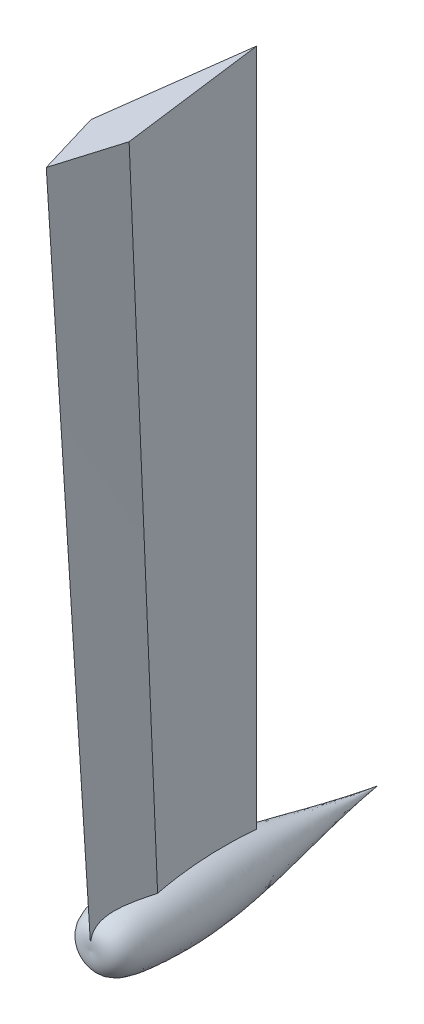
ISO-10303-21;
HEADER;
FILE_DESCRIPTION(('STEP AP214'),'2;1');
FILE_NAME('part.step','',(''),(''),'','','');
FILE_SCHEMA(('AUTOMOTIVE_DESIGN { 1 0 10303 214 1 1 1 1 }'));
ENDSEC;
DATA;
#1=APPLICATION_CONTEXT('core data for automotive mechanical design processes');
#2=APPLICATION_PROTOCOL_DEFINITION('international standard','automotive_design',2000,#1);
#3=PRODUCT_CONTEXT('',#1,'mechanical');
#4=PRODUCT('Part','Part','',(#3));
#5=PRODUCT_RELATED_PRODUCT_CATEGORY('part','',(#4));
#6=PRODUCT_DEFINITION_FORMATION('','',#4);
#7=PRODUCT_DEFINITION_CONTEXT('part definition',#1,'design');
#8=PRODUCT_DEFINITION('design','',#6,#7);
#9=PRODUCT_DEFINITION_SHAPE('','',#8);
#10=(LENGTH_UNIT() NAMED_UNIT(*) SI_UNIT(.MILLI.,.METRE.));
#11=(NAMED_UNIT(*) PLANE_ANGLE_UNIT() SI_UNIT($,.RADIAN.));
#12=(NAMED_UNIT(*) SI_UNIT($,.STERADIAN.) SOLID_ANGLE_UNIT());
#13=UNCERTAINTY_MEASURE_WITH_UNIT(LENGTH_MEASURE(1.E-05),#10,'distance_accuracy_value','');
#14=(GEOMETRIC_REPRESENTATION_CONTEXT(3) GLOBAL_UNCERTAINTY_ASSIGNED_CONTEXT((#13)) GLOBAL_UNIT_ASSIGNED_CONTEXT((#10,
#11,#12)) REPRESENTATION_CONTEXT('',''));
#15=CARTESIAN_POINT('',(0.,0.,0.));
#16=DIRECTION('',(0.,0.,1.));
#17=DIRECTION('',(1.,0.,0.));
#18=AXIS2_PLACEMENT_3D('',#15,#16,#17);
#19=CARTESIAN_POINT('',(0.,0.,0.));
#20=DIRECTION('',(0.,1.,0.));
#21=DIRECTION('',(0.,0.,1.));
#22=AXIS2_PLACEMENT_3D('',#19,#20,#21);
#23=PLANE('',#22);
#24=DIRECTION('',(0.287347885566346,0.,0.957826285221151));
#25=VECTOR('',#24,1.);
#26=CARTESIAN_POINT('',(-30.,0.,230.));
#27=LINE('',#26,#25);
#28=CARTESIAN_POINT('',(-30.,0.,230.));
#29=VERTEX_POINT('',#28);
#30=CARTESIAN_POINT('',(0.,0.,330.));
#31=VERTEX_POINT('',#30);
#32=EDGE_CURVE('E154',#29,#31,#27,.T.);
#33=ORIENTED_EDGE('',*,*,#32,.T.);
#34=DIRECTION('',(0.287347885566345,0.,-0.957826285221151));
#35=VECTOR('',#34,1.);
#36=CARTESIAN_POINT('',(0.,0.,330.));
#37=LINE('',#36,#35);
#38=CARTESIAN_POINT('',(30.,0.,230.));
#39=VERTEX_POINT('',#38);
#40=EDGE_CURVE('E146',#31,#39,#37,.T.);
#41=ORIENTED_EDGE('',*,*,#40,.T.);
#42=DIRECTION('',(-0.129339184067768,0.,-0.991600411186222));
#43=VECTOR('',#42,1.);
#44=CARTESIAN_POINT('',(30.,0.,230.));
#45=LINE('',#44,#43);
#46=CARTESIAN_POINT('',(0.,0.,0.));
#47=VERTEX_POINT('',#46);
#48=EDGE_CURVE('E153',#39,#47,#45,.T.);
#49=ORIENTED_EDGE('',*,*,#48,.T.);
#50=DIRECTION('',(-0.129339184067768,0.,0.991600411186222));
#51=VECTOR('',#50,1.);
#52=CARTESIAN_POINT('',(0.,0.,0.));
#53=LINE('',#52,#51);
#54=EDGE_CURVE('E158',#47,#29,#53,.T.);
#55=ORIENTED_EDGE('',*,*,#54,.T.);
#56=EDGE_LOOP('',(#33,#41,#49,#55));
#57=FACE_BOUND('',#56,.T.);
#58=ADVANCED_FACE('F45',(#57),#23,.T.);
#59=CARTESIAN_POINT('',(0.,0.,0.));
#60=CARTESIAN_POINT('',(0.,-1100.,0.));
#61=CARTESIAN_POINT('',(5.00000000000003,0.,38.3333333333336));
#62=CARTESIAN_POINT('',(3.33333333333331,-1100.,28.8888833333331));
#63=CARTESIAN_POINT('',(10.,0.,76.666666666667));
#64=CARTESIAN_POINT('',(6.66666666666664,-1100.,57.7777666666664));
#65=CARTESIAN_POINT('',(20.0000000000001,0.,153.333333333334));
#66=CARTESIAN_POINT('',(13.3333333333333,-1100.,115.555533333333));
#67=CARTESIAN_POINT('',(25.,0.,191.666666666667));
#68=CARTESIAN_POINT('',(16.6666666666667,-1100.,144.444416666666));
#69=CARTESIAN_POINT('',(30.,0.,230.));
#70=CARTESIAN_POINT('',(20.,-1100.,173.3333));
#71=B_SPLINE_SURFACE_WITH_KNOTS('',3,1,((#59,#60),(#61,#62),(#63,#64),(#65,#66),(#67,#68),(#69,
#70)),.UNSPECIFIED.,.F.,.F.,.F.,(4,2,4),(2,2),(0.,0.5,1.),(0.,1.),.UNSPECIFIED.);
#72=CARTESIAN_POINT('',(0.,-1063.89118838814,0.));
#73=CARTESIAN_POINT('',(0.289059954199147,-1063.42768991305,2.49118317791852));
#74=CARTESIAN_POINT('',(0.578379883597746,-1062.97350731995,4.98407508232796));
#75=CARTESIAN_POINT('',(1.15753243699709,-1062.08457834276,9.97328157182918));
#76=CARTESIAN_POINT('',(1.44736506496862,-1061.64983210989,12.4695961833954));
#77=CARTESIAN_POINT('',(2.02755449899743,-1060.80055352054,17.465814656777));
#78=CARTESIAN_POINT('',(2.3179113451837,-1060.38602278607,19.9657187900877));
#79=CARTESIAN_POINT('',(2.89911326916755,-1059.57815143796,24.9688799208408));
#80=CARTESIAN_POINT('',(3.18995834598358,-1059.18481078178,27.4721369115405));
#81=CARTESIAN_POINT('',(4.06386376526304,-1058.03719515148,34.9925405405973));
#82=CARTESIAN_POINT('',(4.6476475229354,-1057.31627759088,40.0147505721887));
#83=CARTESIAN_POINT('',(5.81697718950069,-1055.97199462778,50.0719184068257));
#84=CARTESIAN_POINT('',(6.40252305689314,-1055.34862694587,55.1068759092119));
#85=CARTESIAN_POINT('',(7.54395854740652,-1054.23891668037,64.9201915027357));
#86=CARTESIAN_POINT('',(8.09976637074969,-1053.74704372051,69.6979310791707));
#87=CARTESIAN_POINT('',(9.21256681440623,-1052.86677909706,79.262854613454));
#88=CARTESIAN_POINT('',(9.76955943493441,-1052.47838745223,84.0500385730148));
#89=CARTESIAN_POINT('',(10.8841021541112,-1051.81314861141,93.6292515194706));
#90=CARTESIAN_POINT('',(11.4416517261332,-1051.53623539006,98.4212759483333));
#91=CARTESIAN_POINT('',(12.5572785592494,-1051.10135731678,108.010773137918));
#92=CARTESIAN_POINT('',(13.1153558255082,-1050.94339364131,112.808245952058));
#93=CARTESIAN_POINT('',(14.2372626412831,-1050.75304292846,122.45448889231));
#94=CARTESIAN_POINT('',(14.8010930180898,-1050.72194824105,127.303284910592));
#95=CARTESIAN_POINT('',(15.9282990657339,-1050.7965917175,136.999867317209));
#96=CARTESIAN_POINT('',(16.4916747515828,-1050.90232516227,141.847653734598));
#97=CARTESIAN_POINT('',(17.3362830923807,-1051.16946830522,149.11842026887));
#98=CARTESIAN_POINT('',(17.6179267447935,-1051.27671187025,151.543437060032));
#99=CARTESIAN_POINT('',(18.1808616562841,-1051.52844213556,156.391587913536));
#100=CARTESIAN_POINT('',(18.4621529171767,-1051.67292864324,158.814721985549));
#101=CARTESIAN_POINT('',(19.0243265948791,-1052.00019766365,163.658771838013));
#102=CARTESIAN_POINT('',(19.3052089543436,-1052.18298510807,166.079687292431));
#103=CARTESIAN_POINT('',(19.8664334481959,-1052.58795821046,170.918327306438));
#104=CARTESIAN_POINT('',(20.1467755721804,-1052.81014461963,173.3360518043));
#105=CARTESIAN_POINT('',(20.4267946929935,-1053.05258377072,175.751804682945));
#106=B_SPLINE_CURVE_WITH_KNOTS('',3,(#72,#73,#74,#75,#76,#77,#78,#79,#80,#81,#82,#83,#84,#85,
#86,#87,#88,#89,#90,#91,#92,#93,#94,#95,#96,#97,#98,#99,#100,#101,#102,#103,#104,#105),
.UNSPECIFIED.,.F.,.F.,(4,2,2,2,2,2,2,2,2,2,2,2,2,2,2,2,4),(0.,7.65109574774084,15.302251013818,
22.9540191677567,30.6057719568119,45.9263356352838,61.246541270747,75.7506449074164,
90.2547511741888,104.75025440741,119.245901006329,133.888844245843,148.531282475879,
155.862063039419,163.192805692432,170.524492845772,177.856319803203),.UNSPECIFIED.);
#107=CARTESIAN_POINT('',(0.,-1063.89118838814,0.));
#108=VERTEX_POINT('',#107);
#109=CARTESIAN_POINT('',(20.4267946929935,-1053.05258377072,175.751804682945));
#110=VERTEX_POINT('',#109);
#111=EDGE_CURVE('E72',#108,#110,#106,.T.);
#112=DIRECTION('',(0.,1.,0.));
#113=VECTOR('',#112,1.);
#114=CARTESIAN_POINT('',(0.,-550.,0.));
#115=LINE('',#114,#113);
#116=EDGE_CURVE('E52',#108,#47,#115,.T.);
#117=DIRECTION('',(-0.00907849611269067,-0.998634572395973,-0.0514448415669008));
#118=VECTOR('',#117,1.);
#119=CARTESIAN_POINT('',(25.,-550.,201.66665));
#120=LINE('',#119,#118);
#121=EDGE_CURVE('E176',#39,#110,#120,.T.);
#122=ORIENTED_EDGE('',*,*,#111,.F.);
#123=ORIENTED_EDGE('',*,*,#116,.T.);
#124=ORIENTED_EDGE('',*,*,#48,.F.);
#125=ORIENTED_EDGE('',*,*,#121,.T.);
#126=EDGE_LOOP('',(#122,#123,#124,#125));
#127=FACE_BOUND('',#126,.T.);
#128=ADVANCED_FACE('F112',(#127),#71,.T.);
#129=CARTESIAN_POINT('',(30.,0.,230.));
#130=CARTESIAN_POINT('',(20.,-1100.,173.3333));
#131=CARTESIAN_POINT('',(25.0000000000001,0.,246.666666666667));
#132=CARTESIAN_POINT('',(16.6666666666667,-1100.,187.77775));
#133=CARTESIAN_POINT('',(20.0000000000001,0.,263.333333333333));
#134=CARTESIAN_POINT('',(13.3333333333334,-1100.,202.2222));
#135=CARTESIAN_POINT('',(10.0000000000001,0.,296.666666666667));
#136=CARTESIAN_POINT('',(6.66666666666673,-1100.,231.1111));
#137=CARTESIAN_POINT('',(5.00000000000007,0.,313.333333333333));
#138=CARTESIAN_POINT('',(3.33333333333337,-1100.,245.55555));
#139=CARTESIAN_POINT('',(0.,0.,330.));
#140=CARTESIAN_POINT('',(0.,-1100.,260.));
#141=B_SPLINE_SURFACE_WITH_KNOTS('',3,1,((#129,#130),(#131,#132),(#133,#134),(#135,#136),(#137,
#138),(#139,#140)),.UNSPECIFIED.,.F.,.F.,.F.,(4,2,4),(2,2),(0.,0.5,1.),(0.,1.),.UNSPECIFIED.);
#142=CARTESIAN_POINT('',(20.4267946929935,-1053.05258377072,175.751804682945));
#143=CARTESIAN_POINT('',(20.247661985632,-1053.01301929513,176.520392582133));
#144=CARTESIAN_POINT('',(20.0684389431817,-1052.9761295679,177.289096816831));
#145=CARTESIAN_POINT('',(19.7098306331835,-1052.90766364979,178.826673566992));
#146=CARTESIAN_POINT('',(19.5304453719875,-1052.8760872592,179.595546075043));
#147=CARTESIAN_POINT('',(19.171522374971,-1052.818209855,181.133432312658));
#148=CARTESIAN_POINT('',(18.991984643335,-1052.79190870101,181.90244603792));
#149=CARTESIAN_POINT('',(18.6327663008933,-1052.74454653362,183.440587939422));
#150=CARTESIAN_POINT('',(18.453085692507,-1052.72348543331,184.209716113551));
#151=CARTESIAN_POINT('',(18.093591131652,-1052.68657019132,185.748060141636));
#152=CARTESIAN_POINT('',(17.9137771801848,-1052.67071601092,186.517275994897));
#153=CARTESIAN_POINT('',(17.5544406795036,-1052.64421416465,188.053992676841));
#154=CARTESIAN_POINT('',(17.3749184154802,-1052.63355456752,188.821493366624));
#155=CARTESIAN_POINT('',(17.0157603609581,-1052.61735859338,190.356526972934));
#156=CARTESIAN_POINT('',(16.8361245697921,-1052.61182224676,191.124059889625));
#157=CARTESIAN_POINT('',(16.4767492223472,-1052.60584549771,192.659129399005));
#158=CARTESIAN_POINT('',(16.2970096650415,-1052.60540514659,193.426665991653));
#159=CARTESIAN_POINT('',(15.9374365196517,-1052.60959602329,194.961714105314));
#160=CARTESIAN_POINT('',(15.7576029303261,-1052.61422731983,195.729225625846));
#161=CARTESIAN_POINT('',(15.397851328217,-1052.62853445903,197.264195549567));
#162=CARTESIAN_POINT('',(15.2179333140939,-1052.63821038463,198.031653951676));
#163=CARTESIAN_POINT('',(14.9255179680085,-1052.6580241855,199.278654555942));
#164=CARTESIAN_POINT('',(14.8130423234942,-1052.66662775565,199.75822669968));
#165=CARTESIAN_POINT('',(14.5880658433847,-1052.68577358354,200.717326400766));
#166=CARTESIAN_POINT('',(14.4755650077708,-1052.69631584273,201.19685395808));
#167=CARTESIAN_POINT('',(14.1380272478191,-1052.73100219915,202.635350162809));
#168=CARTESIAN_POINT('',(13.9129533134621,-1052.75820599214,203.59423983542));
#169=CARTESIAN_POINT('',(13.4627069289795,-1052.82286986124,205.511660097506));
#170=CARTESIAN_POINT('',(13.2375344785192,-1052.86032997248,206.470190685741));
#171=CARTESIAN_POINT('',(12.7870917668886,-1052.94754919271,208.386754052072));
#172=CARTESIAN_POINT('',(12.5618214996628,-1052.99730922129,209.344786787579));
#173=CARTESIAN_POINT('',(12.1102178416966,-1053.11153081013,211.264319750951));
#174=CARTESIAN_POINT('',(11.8838842459312,-1053.17605777439,212.225816089926));
#175=CARTESIAN_POINT('',(11.4312311840368,-1053.32198205871,214.147546351148));
#176=CARTESIAN_POINT('',(11.2049117179255,-1053.40337939955,215.107780271836));
#177=CARTESIAN_POINT('',(10.7523947977458,-1053.58550720706,217.026379729035));
#178=CARTESIAN_POINT('',(10.5261973355337,-1053.68623616442,217.984745405512));
#179=CARTESIAN_POINT('',(10.0740349746344,-1053.90972110892,219.898981863082));
#180=CARTESIAN_POINT('',(9.84807007595939,-1054.03247709724,220.854852644046));
#181=CARTESIAN_POINT('',(9.39294228899679,-1054.30513852362,222.778425077599));
#182=CARTESIAN_POINT('',(9.16378599132828,-1054.45544641673,223.74607173316));
#183=CARTESIAN_POINT('',(8.70613174820383,-1054.78531704116,225.676642824005));
#184=CARTESIAN_POINT('',(8.47763385530765,-1054.96488204562,226.639566886374));
#185=CARTESIAN_POINT('',(8.02159968803861,-1055.35716143285,228.559187145793));
#186=CARTESIAN_POINT('',(7.79406367179696,-1055.56988419754,229.515881704213));
#187=CARTESIAN_POINT('',(7.34027442537468,-1056.03295770856,231.42143042086));
#188=CARTESIAN_POINT('',(7.11402249168783,-1056.28334121315,232.370276987125));
#189=CARTESIAN_POINT('',(6.66520655011126,-1056.82449283214,234.249746884016));
#190=CARTESIAN_POINT('',(6.44262779552342,-1057.1149644816,235.180451451911));
#191=CARTESIAN_POINT('',(6.00036750044668,-1057.7427507293,237.026651140962));
#192=CARTESIAN_POINT('',(5.78068571304124,-1058.0800613067,237.942147560101));
#193=CARTESIAN_POINT('',(5.34551266993721,-1058.80665319772,239.752147951441));
#194=CARTESIAN_POINT('',(5.13001686098293,-1059.1958739456,240.646674980672));
#195=CARTESIAN_POINT('',(4.70452920455502,-1060.03186225975,242.408841230099));
#196=CARTESIAN_POINT('',(4.49453198462602,-1060.47857092354,243.276506859167));
#197=CARTESIAN_POINT('',(4.10321121048743,-1061.38503720079,244.888958548351));
#198=CARTESIAN_POINT('',(3.92118896017871,-1061.838521787,245.637093180043));
#199=CARTESIAN_POINT('',(3.5642559454073,-1062.79948866035,247.099879111454));
#200=CARTESIAN_POINT('',(3.3893446393385,-1063.30696682436,247.814532961876));
#201=CARTESIAN_POINT('',(3.13370906999497,-1064.10992891908,248.855377713394));
#202=CARTESIAN_POINT('',(3.04964107049295,-1064.38446005756,249.197047895362));
#203=CARTESIAN_POINT('',(2.88394504893907,-1064.94761424872,249.869162880735));
#204=CARTESIAN_POINT('',(2.80231678390051,-1065.23623589045,250.199608802477));
#205=CARTESIAN_POINT('',(2.64171988212411,-1065.82762157211,250.848335464282));
#206=CARTESIAN_POINT('',(2.56275150565245,-1066.13038698911,251.166615014293));
#207=CARTESIAN_POINT('',(2.40771906525202,-1066.7498743481,251.789975546704));
#208=CARTESIAN_POINT('',(2.33165478989933,-1067.06659527049,252.095057490129));
#209=CARTESIAN_POINT('',(2.15700244577121,-1067.82513800531,252.793693744574));
#210=CARTESIAN_POINT('',(2.05966974395517,-1068.27250753384,253.181570556915));
#211=CARTESIAN_POINT('',(1.87114047058279,-1069.19099540724,253.929762692093));
#212=CARTESIAN_POINT('',(1.77994425753028,-1069.66211513683,254.290076404818));
#213=CARTESIAN_POINT('',(1.60412082676897,-1070.62654558403,254.981376992815));
#214=CARTESIAN_POINT('',(1.51949324657947,-1071.11985507474,255.312365486502));
#215=CARTESIAN_POINT('',(1.35710783853937,-1072.12690914411,255.94382181814));
#216=CARTESIAN_POINT('',(1.27935192903613,-1072.64065937147,256.24428113682));
#217=CARTESIAN_POINT('',(1.13094367746939,-1073.68629695834,256.813800408786));
#218=CARTESIAN_POINT('',(1.06029169053885,-1074.2181852228,257.082858792412));
#219=CARTESIAN_POINT('',(0.926193882887311,-1075.29761416074,257.589266081774));
#220=CARTESIAN_POINT('',(0.862747328065377,-1075.84515323257,257.826618218228));
#221=CARTESIAN_POINT('',(0.720774486052322,-1077.15955890325,258.352260938599));
#222=CARTESIAN_POINT('',(0.645403523386183,-1077.93233247762,258.626713572201));
#223=CARTESIAN_POINT('',(0.507778630057192,-1079.49684481869,259.11836526661));
#224=CARTESIAN_POINT('',(0.44552461228075,-1080.28858345939,259.335564707654));
#225=CARTESIAN_POINT('',(0.3334200928994,-1081.88618347519,259.715984962754));
#226=CARTESIAN_POINT('',(0.283576874539941,-1082.69205284735,259.879174099406));
#227=CARTESIAN_POINT('',(0.195505052042101,-1084.31278096016,260.155193376738));
#228=CARTESIAN_POINT('',(0.157274848168721,-1085.12763844661,260.268030454604));
#229=CARTESIAN_POINT('',(0.0961627799686429,-1086.64670480338,260.434763460026));
#230=CARTESIAN_POINT('',(0.0718725899342358,-1087.35020210213,260.494752199397));
#231=CARTESIAN_POINT('',(0.0409244166612267,-1088.40583836965,260.561109848738));
#232=CARTESIAN_POINT('',(0.0315339209652564,-1088.75719967449,260.579280824703));
#233=CARTESIAN_POINT('',(0.0144852970171998,-1089.46031014309,260.608141051288));
#234=CARTESIAN_POINT('',(0.00682735348107901,-1089.8120593442,260.618829504414));
#235=CARTESIAN_POINT('',(0.,-1090.16390200341,260.625933508874));
#236=B_SPLINE_CURVE_WITH_KNOTS('',3,(#142,#143,#144,#145,#146,#147,#148,#149,#150,#151,#152,
#153,#154,#155,#156,#157,#158,#159,#160,#161,#162,#163,#164,#165,#166,#167,#168,#169,#170,#171,
#172,#173,#174,#175,#176,#177,#178,#179,#180,#181,#182,#183,#184,#185,#186,#187,#188,#189,#190,
#191,#192,#193,#194,#195,#196,#197,#198,#199,#200,#201,#202,#203,#204,#205,#206,#207,#208,#209,
#210,#211,#212,#213,#214,#215,#216,#217,#218,#219,#220,#221,#222,#223,#224,#225,#226,#227,#228,
#229,#230,#231,#232,#233,#234,#235),.UNSPECIFIED.,.F.,.F.,(4,2,2,2,2,2,2,2,2,2,2,2,2,2,2,2,2,2,
2,2,2,2,2,2,2,2,2,2,2,2,2,2,2,2,2,2,2,2,2,2,2,2,2,2,2,2,4),(0.,2.37052896059913,
4.74096880355761,7.11134556586554,9.48168301032502,11.8520028295675,14.2168523793697,
16.5817159608773,18.9466033595139,21.3115228093343,23.6764811432664,25.1544584860136,
26.6324369244791,29.5883707124422,32.5443146217553,35.5004795939955,38.4700001468394,
41.4395243583207,44.4088168183665,47.3781094342587,50.3948454466493,53.4118159564354,
56.4295503641287,59.4499250178313,62.4490535768944,65.4479248378769,68.4433273109994,
71.4356847538952,74.1144633841217,76.7930376010696,78.1315965114617,79.4700216600724,
80.8085773934007,82.1470354908532,83.9460313567496,85.7451322318735,87.5441337554806,
89.3436359258172,91.143228010577,92.942636585226,95.4105839970127,97.8785150178993,
100.347890942259,102.816926546679,104.935504536158,105.99130050903,107.047208992549),.UNSPECIFIED.);
#237=CARTESIAN_POINT('',(0.,-1090.16390200341,260.625933508874));
#238=VERTEX_POINT('',#237);
#239=EDGE_CURVE('E65',#110,#238,#236,.T.);
#240=DIRECTION('',(0.,-0.997981335614178,-0.0635079031754477));
#241=VECTOR('',#240,1.);
#242=CARTESIAN_POINT('',(0.,-550.,295.));
#243=LINE('',#242,#241);
#244=EDGE_CURVE('E172',#31,#238,#243,.T.);
#245=ORIENTED_EDGE('',*,*,#239,.F.);
#246=ORIENTED_EDGE('',*,*,#121,.F.);
#247=ORIENTED_EDGE('',*,*,#40,.F.);
#248=ORIENTED_EDGE('',*,*,#244,.T.);
#249=EDGE_LOOP('',(#245,#246,#247,#248));
#250=FACE_BOUND('',#249,.T.);
#251=ADVANCED_FACE('F117',(#250),#141,.T.);
#252=CARTESIAN_POINT('',(-30.,0.,230.));
#253=CARTESIAN_POINT('',(-20.,-1100.,173.3333));
#254=CARTESIAN_POINT('',(-25.,0.,191.666666666667));
#255=CARTESIAN_POINT('',(-16.6666666666667,-1100.,144.444416666667));
#256=CARTESIAN_POINT('',(-20.,0.,153.333333333333));
#257=CARTESIAN_POINT('',(-13.3333333333333,-1100.,115.555533333333));
#258=CARTESIAN_POINT('',(-9.99999999999999,0.,76.6666666666667));
#259=CARTESIAN_POINT('',(-6.66666666666666,-1100.,57.7777666666667));
#260=CARTESIAN_POINT('',(-5.,0.,38.3333333333334));
#261=CARTESIAN_POINT('',(-3.33333333333333,-1100.,28.8888833333333));
#262=CARTESIAN_POINT('',(0.,0.,0.));
#263=CARTESIAN_POINT('',(0.,-1100.,0.));
#264=B_SPLINE_SURFACE_WITH_KNOTS('',3,1,((#252,#253),(#254,#255),(#256,#257),(#258,#259),(#260,
#261),(#262,#263)),.UNSPECIFIED.,.F.,.F.,.F.,(4,2,4),(2,2),(0.,0.5,1.),(0.,1.),.UNSPECIFIED.);
#265=CARTESIAN_POINT('',(-20.4267946929935,-1053.05258377072,175.751804682945));
#266=CARTESIAN_POINT('',(-20.2003970315575,-1052.85656365195,173.798648924684));
#267=CARTESIAN_POINT('',(-19.973789694765,-1052.67379092388,171.844217680192));
#268=CARTESIAN_POINT('',(-19.5202081290842,-1052.33414084139,167.933170967529));
#269=CARTESIAN_POINT('',(-19.2932339045403,-1052.17726318259,165.976555525307));
#270=CARTESIAN_POINT('',(-18.6118722277801,-1051.74459308805,160.104264291133));
#271=CARTESIAN_POINT('',(-18.1570052517242,-1051.50672868151,156.185794046074));
#272=CARTESIAN_POINT('',(-17.2468307751638,-1051.12793458922,148.347979137534));
#273=CARTESIAN_POINT('',(-16.7915240675371,-1050.98691572892,144.428638611542));
#274=CARTESIAN_POINT('',(-15.8803828597136,-1050.79729200445,136.587723854318));
#275=CARTESIAN_POINT('',(-15.4245483491779,-1050.74868898229,132.66614958012));
#276=CARTESIAN_POINT('',(-14.5128234638035,-1050.73982283315,124.824258913555));
#277=CARTESIAN_POINT('',(-14.0569331575655,-1050.77953042952,120.903942535108));
#278=CARTESIAN_POINT('',(-13.1452155616128,-1050.94314494566,113.065051867762));
#279=CARTESIAN_POINT('',(-12.6893882725437,-1051.06705267213,109.146477595913));
#280=CARTESIAN_POINT('',(-11.7777954875476,-1051.39502792234,101.31055378335));
#281=CARTESIAN_POINT('',(-11.322030157427,-1051.59913862672,97.3932060419089));
#282=CARTESIAN_POINT('',(-10.4110185931487,-1052.08330989485,89.5631902912953));
#283=CARTESIAN_POINT('',(-9.9557723603577,-1052.36337065811,85.6505222944421));
#284=CARTESIAN_POINT('',(-8.70280440363261,-1053.23350915111,74.8814188205148));
#285=CARTESIAN_POINT('',(-7.90579232969139,-1053.89808099887,68.0308403218465));
#286=CARTESIAN_POINT('',(-6.31456357642042,-1055.42474681288,54.3507961757562));
#287=CARTESIAN_POINT('',(-5.520347262228,-1056.28686567378,47.5213332993275));
#288=CARTESIAN_POINT('',(-4.33201545146928,-1057.71058984494,37.2992691915883));
#289=CARTESIAN_POINT('',(-3.93662647295036,-1058.2066047477,33.8975211639017));
#290=CARTESIAN_POINT('',(-3.14671983271788,-1059.23960154723,27.100113666383));
#291=CARTESIAN_POINT('',(-2.75220217659458,-1059.77658370606,23.7044542356403));
#292=CARTESIAN_POINT('',(-1.96418622731623,-1060.8888653793,16.9203052855667));
#293=CARTESIAN_POINT('',(-1.57068767765952,-1061.46415402541,13.5318140116214));
#294=CARTESIAN_POINT('',(-0.981145229999928,-1062.35426355903,8.45381410185661));
#295=CARTESIAN_POINT('',(-0.784750413577768,-1062.65549332194,6.76195221928493));
#296=CARTESIAN_POINT('',(-0.392197319878571,-1063.26677927094,3.37979910224857));
#297=CARTESIAN_POINT('',(-0.196039042197094,-1063.57683544191,1.68950786509952));
#298=CARTESIAN_POINT('',(0.,-1063.89118838814,0.));
#299=B_SPLINE_CURVE_WITH_KNOTS('',3,(#265,#266,#267,#268,#269,#270,#271,#272,#273,#274,#275,
#276,#277,#278,#279,#280,#281,#282,#283,#284,#285,#286,#287,#288,#289,#290,#291,#292,#293,#294,
#295,#296,#297,#298),.UNSPECIFIED.,.F.,.F.,(4,2,2,2,2,2,2,2,2,2,2,2,2,2,2,2,4),(0.,
5.92784148481291,11.8556132825908,23.7100963781911,35.5536492781173,47.3974382377727,
59.2373013419414,71.0772778800799,82.9236377179401,94.7700286739094,115.552776803586,
136.338145392325,146.719090188097,157.10010139388,167.478179747784,172.667125227365,
177.856061822133),.UNSPECIFIED.);
#300=CARTESIAN_POINT('',(-20.4267946929935,-1053.05258377072,175.751804682945));
#301=VERTEX_POINT('',#300);
#302=EDGE_CURVE('E174',#301,#108,#299,.T.);
#303=DIRECTION('',(0.00907849611269066,-0.998634572395973,-0.0514448415669008));
#304=VECTOR('',#303,1.);
#305=CARTESIAN_POINT('',(-25.,-550.,201.66665));
#306=LINE('',#305,#304);
#307=EDGE_CURVE('E58',#29,#301,#306,.T.);
#308=ORIENTED_EDGE('',*,*,#302,.F.);
#309=ORIENTED_EDGE('',*,*,#307,.F.);
#310=ORIENTED_EDGE('',*,*,#54,.F.);
#311=ORIENTED_EDGE('',*,*,#116,.F.);
#312=EDGE_LOOP('',(#308,#309,#310,#311));
#313=FACE_BOUND('',#312,.T.);
#314=ADVANCED_FACE('F105',(#313),#264,.T.);
#315=CARTESIAN_POINT('',(0.,0.,330.));
#316=CARTESIAN_POINT('',(0.,-1100.,260.));
#317=CARTESIAN_POINT('',(-4.99999999999999,0.,313.333333333333));
#318=CARTESIAN_POINT('',(-3.33333333333334,-1100.,245.55555));
#319=CARTESIAN_POINT('',(-10.,0.,296.666666666667));
#320=CARTESIAN_POINT('',(-6.66666666666668,-1100.,231.1111));
#321=CARTESIAN_POINT('',(-20.,0.,263.333333333333));
#322=CARTESIAN_POINT('',(-13.3333333333333,-1100.,202.2222));
#323=CARTESIAN_POINT('',(-25.,0.,246.666666666667));
#324=CARTESIAN_POINT('',(-16.6666666666667,-1100.,187.77775));
#325=CARTESIAN_POINT('',(-30.,0.,230.));
#326=CARTESIAN_POINT('',(-20.,-1100.,173.3333));
#327=B_SPLINE_SURFACE_WITH_KNOTS('',3,1,((#315,#316),(#317,#318),(#319,#320),(#321,#322),(#323,
#324),(#325,#326)),.UNSPECIFIED.,.F.,.F.,.F.,(4,2,4),(2,2),(0.,0.5,1.),(0.,1.),.UNSPECIFIED.);
#328=CARTESIAN_POINT('',(0.,-1090.16390200341,260.625933508874));
#329=CARTESIAN_POINT('',(-0.00840289035002761,-1089.73087833227,260.617189372465));
#330=CARTESIAN_POINT('',(-0.0180641255839688,-1089.29797031045,260.603016316019));
#331=CARTESIAN_POINT('',(-0.0400495497478748,-1088.43229018385,260.563200852816));
#332=CARTESIAN_POINT('',(-0.0523765638846156,-1087.99951871488,260.537546246762));
#333=CARTESIAN_POINT('',(-0.0798298428292349,-1087.13470855181,260.474155286453));
#334=CARTESIAN_POINT('',(-0.0949576044386855,-1086.70267037479,260.43641246399));
#335=CARTESIAN_POINT('',(-0.128147842108979,-1085.83993744657,260.348236339057));
#336=CARTESIAN_POINT('',(-0.146210724967238,-1085.40924289003,260.297801276953));
#337=CARTESIAN_POINT('',(-0.185577741274897,-1084.54600160752,260.183137758303));
#338=CARTESIAN_POINT('',(-0.206908781994299,-1084.11347151291,260.118792783168));
#339=CARTESIAN_POINT('',(-0.252827090345287,-1083.25102065313,259.975977218675));
#340=CARTESIAN_POINT('',(-0.277413593766995,-1082.82109930026,259.897509942935));
#341=CARTESIAN_POINT('',(-0.329973727555578,-1081.96448235573,259.725862353619));
#342=CARTESIAN_POINT('',(-0.357946743484681,-1081.53778619378,259.632684708114));
#343=CARTESIAN_POINT('',(-0.417405263877674,-1080.68824717492,259.431052407948));
#344=CARTESIAN_POINT('',(-0.44889091954998,-1080.26540448473,259.322597095578));
#345=CARTESIAN_POINT('',(-0.526892390941683,-1079.2802709825,259.050041324336));
#346=CARTESIAN_POINT('',(-0.574862223258972,-1078.71982929698,258.879605884335));
#347=CARTESIAN_POINT('',(-0.677544507191097,-1077.60931442676,258.509275405397));
#348=CARTESIAN_POINT('',(-0.732257660286347,-1077.05924232764,258.309377301155));
#349=CARTESIAN_POINT('',(-0.848554509572272,-1075.97171225372,257.879463115464));
#350=CARTESIAN_POINT('',(-0.910138163222405,-1075.43425420083,257.649447220497));
#351=CARTESIAN_POINT('',(-1.03994724510677,-1074.37637594316,257.160027893035));
#352=CARTESIAN_POINT('',(-1.1081446564933,-1073.85589535988,256.900747723518));
#353=CARTESIAN_POINT('',(-1.25131881452883,-1072.83189881931,256.352239656753));
#354=CARTESIAN_POINT('',(-1.32629572261214,-1072.3283832664,256.063011046344));
#355=CARTESIAN_POINT('',(-1.48284358851017,-1071.34042192088,255.455288386295));
#356=CARTESIAN_POINT('',(-1.56441402421213,-1070.85597462285,255.136796653602));
#357=CARTESIAN_POINT('',(-1.71111480366056,-1070.03519763351,254.560967570978));
#358=CARTESIAN_POINT('',(-1.77478305285938,-1069.69400550772,254.310153639638));
#359=CARTESIAN_POINT('',(-1.90535425580075,-1069.02335086856,253.794040601903));
#360=CARTESIAN_POINT('',(-1.97225742043224,-1068.69388912235,253.528740550989));
#361=CARTESIAN_POINT('',(-2.10911851712335,-1068.04725606297,252.984393033735));
#362=CARTESIAN_POINT('',(-2.17907611492019,-1067.73008341206,252.705347071256));
#363=CARTESIAN_POINT('',(-2.32187583269023,-1067.10832434062,252.134219107158));
#364=CARTESIAN_POINT('',(-2.39471824237379,-1066.8037391905,251.842135795874));
#365=CARTESIAN_POINT('',(-2.54319834459389,-1066.20698006666,251.245326680368));
#366=CARTESIAN_POINT('',(-2.61884009483317,-1065.91482554338,250.940582438655));
#367=CARTESIAN_POINT('',(-2.77261294421879,-1065.34352644918,250.319720860216));
#368=CARTESIAN_POINT('',(-2.85074429055589,-1065.06438317696,250.003602393743));
#369=CARTESIAN_POINT('',(-3.08856746455428,-1064.24651817091,249.039485095564));
#370=CARTESIAN_POINT('',(-3.25170661948564,-1063.7272885011,248.375651219165));
#371=CARTESIAN_POINT('',(-3.57436649881485,-1062.77293116125,247.058404267802));
#372=CARTESIAN_POINT('',(-3.73340510036041,-1062.33450578797,246.407239475352));
#373=CARTESIAN_POINT('',(-4.05691885501233,-1061.50011686348,245.079240340581));
#374=CARTESIAN_POINT('',(-4.22139613095941,-1061.10417015484,244.402395959359));
#375=CARTESIAN_POINT('',(-4.55470211942799,-1060.352432018,243.027785336521));
#376=CARTESIAN_POINT('',(-4.72353141642758,-1059.99664601828,242.330016282636));
#377=CARTESIAN_POINT('',(-5.06501910241377,-1059.32172452047,240.915975696546));
#378=CARTESIAN_POINT('',(-5.2376851467279,-1059.00267197614,240.199666593743));
#379=CARTESIAN_POINT('',(-5.58571033364693,-1058.39925753139,238.753484902122));
#380=CARTESIAN_POINT('',(-5.76106886205929,-1058.11488784791,238.023615398867));
#381=CARTESIAN_POINT('',(-6.11389811850718,-1057.57788866136,236.552946802033));
#382=CARTESIAN_POINT('',(-6.29136864795641,-1057.32525619954,235.812148734495));
#383=CARTESIAN_POINT('',(-6.74990417500664,-1056.7127054399,233.895659296747));
#384=CARTESIAN_POINT('',(-7.03219089445493,-1056.37401990692,232.713456756689));
#385=CARTESIAN_POINT('',(-7.59958165070183,-1055.75793993726,230.333202275315));
#386=CARTESIAN_POINT('',(-7.88468750226184,-1055.48058808524,229.135139930251));
#387=CARTESIAN_POINT('',(-8.45692579176721,-1054.97840385553,226.727009907283));
#388=CARTESIAN_POINT('',(-8.74406030571337,-1054.7536370854,225.516929175235));
#389=CARTESIAN_POINT('',(-9.31957334183287,-1054.34926452463,223.088497565495));
#390=CARTESIAN_POINT('',(-9.60795272910963,-1054.16969820325,221.870140407457));
#391=CARTESIAN_POINT('',(-10.1852072096213,-1053.84933934449,219.428698874416));
#392=CARTESIAN_POINT('',(-10.4740822309534,-1053.70854159438,218.205615157385));
#393=CARTESIAN_POINT('',(-11.0541030721542,-1053.45895628212,215.747540118185));
#394=CARTESIAN_POINT('',(-11.3452504888886,-1053.35040241209,214.512525799321));
#395=CARTESIAN_POINT('',(-11.9272722944959,-1053.16141820383,212.041659384068));
#396=CARTESIAN_POINT('',(-12.2181466591177,-1053.08095930733,210.805809425339));
#397=CARTESIAN_POINT('',(-12.7996586129498,-1052.94320893364,208.333422627332));
#398=CARTESIAN_POINT('',(-13.0902962485831,-1052.88590624315,207.096886411567));
#399=CARTESIAN_POINT('',(-13.5261113793395,-1052.81389670536,205.241635358371));
#400=CARTESIAN_POINT('',(-13.6713484609488,-1052.79221873116,204.623191084344));
#401=CARTESIAN_POINT('',(-13.9617823308927,-1052.75297500098,203.386160929784));
#402=CARTESIAN_POINT('',(-14.1069791191749,-1052.73540925032,202.76757504907));
#403=CARTESIAN_POINT('',(-14.3973351765601,-1052.70379527448,201.530292012854));
#404=CARTESIAN_POINT('',(-14.5424944447852,-1052.68974712526,200.911594855239));
#405=CARTESIAN_POINT('',(-14.832771106486,-1052.66486334572,199.674127400524));
#406=CARTESIAN_POINT('',(-14.9778885000366,-1052.65402770963,199.055357103559));
#407=CARTESIAN_POINT('',(-15.3014945386557,-1052.6335189808,197.675230760461));
#408=CARTESIAN_POINT('',(-15.4799709972625,-1052.62468847698,196.913859169625));
#409=CARTESIAN_POINT('',(-15.8368523724562,-1052.61199341714,195.391012729172));
#410=CARTESIAN_POINT('',(-16.015257284438,-1052.60812914135,194.629537876152));
#411=CARTESIAN_POINT('',(-16.3719828064855,-1052.60539660919,193.106526415467));
#412=CARTESIAN_POINT('',(-16.5503034127982,-1052.6065285575,192.344989806551));
#413=CARTESIAN_POINT('',(-16.9068475389948,-1052.61381257775,190.821896866903));
#414=CARTESIAN_POINT('',(-17.085071056222,-1052.61996478077,190.060340536174));
#415=CARTESIAN_POINT('',(-17.4414081814431,-1052.63731668631,188.537250009506));
#416=CARTESIAN_POINT('',(-17.6195217881026,-1052.64851644896,187.775715813939));
#417=CARTESIAN_POINT('',(-17.9732025155197,-1052.67580473686,186.263077292351));
#418=CARTESIAN_POINT('',(-18.1487712928489,-1052.69182463177,185.511972115509));
#419=CARTESIAN_POINT('',(-18.4997777741451,-1052.72883168784,184.009860942147));
#420=CARTESIAN_POINT('',(-18.6752154793401,-1052.74981880187,183.258854944755));
#421=CARTESIAN_POINT('',(-19.0259480963867,-1052.79679061714,181.756979240142));
#422=CARTESIAN_POINT('',(-19.201243010601,-1052.82277523394,181.006109530834));
#423=CARTESIAN_POINT('',(-19.5516782874921,-1052.87977391777,179.504543473128));
#424=CARTESIAN_POINT('',(-19.7268186537035,-1052.91078786662,178.753847121072));
#425=CARTESIAN_POINT('',(-20.0769329440965,-1052.97787939327,177.252665110128));
#426=CARTESIAN_POINT('',(-20.251906872991,-1053.01395682312,176.502179445724));
#427=CARTESIAN_POINT('',(-20.4267946929935,-1053.05258377072,175.751804682945));
#428=B_SPLINE_CURVE_WITH_KNOTS('',3,(#328,#329,#330,#331,#332,#333,#334,#335,#336,#337,#338,
#339,#340,#341,#342,#343,#344,#345,#346,#347,#348,#349,#350,#351,#352,#353,#354,#355,#356,#357,
#358,#359,#360,#361,#362,#363,#364,#365,#366,#367,#368,#369,#370,#371,#372,#373,#374,#375,#376,
#377,#378,#379,#380,#381,#382,#383,#384,#385,#386,#387,#388,#389,#390,#391,#392,#393,#394,#395,
#396,#397,#398,#399,#400,#401,#402,#403,#404,#405,#406,#407,#408,#409,#410,#411,#412,#413,#414,
#415,#416,#417,#418,#419,#420,#421,#422,#423,#424,#425,#426,#427),.UNSPECIFIED.,.F.,.F.,(4,2,2,
2,2,2,2,2,2,2,2,2,2,2,2,2,2,2,2,2,2,2,2,2,2,2,2,2,2,2,2,2,2,2,2,2,2,2,2,2,2,2,2,2,2,2,2,2,2,4),
(0.,1.29957175522139,2.60052761293989,3.90218075718212,5.20401446005728,6.5172077328266,
7.83009328223105,9.14274098196219,10.4554452089878,12.2178206979555,13.9803796747088,
15.7429277387125,17.4983109431987,19.2537359581258,21.0090221045014,22.2932922607219,
23.5776462535999,24.8618600434014,26.146203130435,27.4324870286441,28.7188990417656,
31.291409707334,33.6926626506481,36.0948641869144,38.4973900381008,40.9052392021232,
43.3125470309278,45.7196302673189,49.5028092985702,53.2886068427857,57.0791028292612,
60.8728973028993,64.6661814216736,68.4863222483623,72.3025685576473,76.1169646461772,
78.0238717537812,79.9307813312146,81.8377320853531,83.7446794123002,86.0908443521692,
88.4371416778069,90.7835351258322,93.1299898407584,95.4764725033051,97.7910106253284,
100.105526786886,102.42000383965,104.734426510806,107.048781568093),.UNSPECIFIED.);
#429=EDGE_CURVE('E12',#238,#301,#428,.T.);
#430=ORIENTED_EDGE('',*,*,#429,.F.);
#431=ORIENTED_EDGE('',*,*,#244,.F.);
#432=ORIENTED_EDGE('',*,*,#32,.F.);
#433=ORIENTED_EDGE('',*,*,#307,.T.);
#434=EDGE_LOOP('',(#430,#431,#432,#433));
#435=FACE_BOUND('',#434,.T.);
#436=ADVANCED_FACE('F47',(#435),#327,.T.);
#437=CARTESIAN_POINT('',(0.,-1100.,260.));
#438=CARTESIAN_POINT('',(41.0128147878401,-1100.,265.650566115994));
#439=CARTESIAN_POINT('',(71.9997883114548,-1100.,83.7287256857784));
#440=CARTESIAN_POINT('',(18.7032589487134,-1100.,-55.4773348435762));
#441=CARTESIAN_POINT('',(0.,-1100.,-190.));
#442=B_SPLINE_CURVE_WITH_KNOTS('',3,(#437,#438,#439,#440,#441),.UNSPECIFIED.,.F.,.F.,(4,1,4),
(0.,0.181249158843449,1.),.UNSPECIFIED.);
#443=CARTESIAN_POINT('',(0.,-1100.,260.));
#444=DIRECTION('',(0.,0.,1.));
#445=AXIS1_PLACEMENT('',#443,#444);
#446=SURFACE_OF_REVOLUTION('',#442,#445);
#447=ORIENTED_EDGE('',*,*,#302,.T.);
#448=ORIENTED_EDGE('',*,*,#111,.T.);
#449=ORIENTED_EDGE('',*,*,#239,.T.);
#450=ORIENTED_EDGE('',*,*,#429,.T.);
#451=EDGE_LOOP('',(#447,#448,#449,#450));
#452=FACE_BOUND('',#451,.T.);
#453=CARTESIAN_POINT('',(0.,-1100.,-190.));
#454=VERTEX_POINT('',#453);
#455=VERTEX_LOOP('',#454);
#456=FACE_BOUND('',#455,.T.);
#457=CARTESIAN_POINT('',(0.,-1100.,260.));
#458=VERTEX_POINT('',#457);
#459=VERTEX_LOOP('',#458);
#460=FACE_BOUND('',#459,.T.);
#461=ADVANCED_FACE('F97',(#452,#456,#460),#446,.F.);
#462=CLOSED_SHELL('',(#58,#128,#251,#314,#436,#461));
#463=MANIFOLD_SOLID_BREP('B2',#462);
#464=ADVANCED_BREP_SHAPE_REPRESENTATION('',(#18,#463),#14);
#465=SHAPE_DEFINITION_REPRESENTATION(#9,#464);
ENDSEC;
END-ISO-10303-21;
